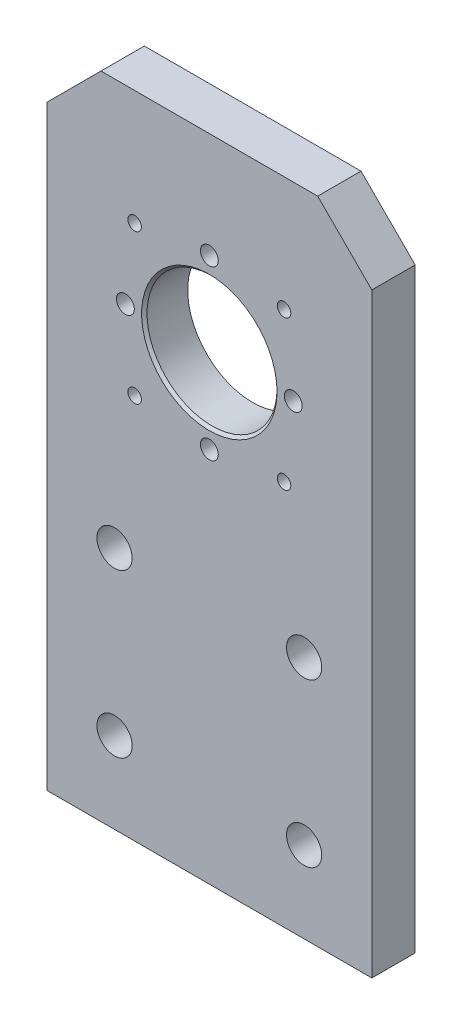
ISO-10303-21;
HEADER;
FILE_DESCRIPTION(('STEP AP214'),'2;1');
FILE_NAME('part.step','',(''),(''),'','','');
FILE_SCHEMA(('AUTOMOTIVE_DESIGN { 1 0 10303 214 1 1 1 1 }'));
ENDSEC;
DATA;
#1=APPLICATION_CONTEXT('core data for automotive mechanical design processes');
#2=APPLICATION_PROTOCOL_DEFINITION('international standard','automotive_design',2000,#1);
#3=PRODUCT_CONTEXT('',#1,'mechanical');
#4=PRODUCT('Part','Part','',(#3));
#5=PRODUCT_RELATED_PRODUCT_CATEGORY('part','',(#4));
#6=PRODUCT_DEFINITION_FORMATION('','',#4);
#7=PRODUCT_DEFINITION_CONTEXT('part definition',#1,'design');
#8=PRODUCT_DEFINITION('design','',#6,#7);
#9=PRODUCT_DEFINITION_SHAPE('','',#8);
#10=(LENGTH_UNIT() NAMED_UNIT(*) SI_UNIT(.MILLI.,.METRE.));
#11=(NAMED_UNIT(*) PLANE_ANGLE_UNIT() SI_UNIT($,.RADIAN.));
#12=(NAMED_UNIT(*) SI_UNIT($,.STERADIAN.) SOLID_ANGLE_UNIT());
#13=UNCERTAINTY_MEASURE_WITH_UNIT(LENGTH_MEASURE(1.E-05),#10,'distance_accuracy_value','');
#14=(GEOMETRIC_REPRESENTATION_CONTEXT(3) GLOBAL_UNCERTAINTY_ASSIGNED_CONTEXT((#13)) GLOBAL_UNIT_ASSIGNED_CONTEXT((#10,
#11,#12)) REPRESENTATION_CONTEXT('',''));
#15=CARTESIAN_POINT('',(0.,0.,0.));
#16=DIRECTION('',(0.,0.,1.));
#17=DIRECTION('',(1.,0.,0.));
#18=AXIS2_PLACEMENT_3D('',#15,#16,#17);
#19=CARTESIAN_POINT('',(0.,0.,8.));
#20=DIRECTION('',(0.,0.,1.));
#21=DIRECTION('',(1.,0.,0.));
#22=AXIS2_PLACEMENT_3D('',#19,#20,#21);
#23=PLANE('',#22);
#24=CARTESIAN_POINT('',(0.,25.,8.));
#25=DIRECTION('',(0.,0.,1.));
#26=DIRECTION('',(1.,0.,0.));
#27=AXIS2_PLACEMENT_3D('',#24,#25,#26);
#28=CIRCLE('',#27,12.5);
#29=CARTESIAN_POINT('',(12.5,25.,8.));
#30=VERTEX_POINT('',#29);
#31=EDGE_CURVE('E113',#30,#30,#28,.F.);
#32=ORIENTED_EDGE('',*,*,#31,.T.);
#33=EDGE_LOOP('',(#32));
#34=FACE_BOUND('',#33,.T.);
#35=CARTESIAN_POINT('',(-15.5,25.,8.));
#36=DIRECTION('',(0.,0.,1.));
#37=DIRECTION('',(1.,0.,0.));
#38=AXIS2_PLACEMENT_3D('',#35,#36,#37);
#39=CIRCLE('',#38,1.64999999999999);
#40=CARTESIAN_POINT('',(-13.85,25.,8.));
#41=VERTEX_POINT('',#40);
#42=EDGE_CURVE('E226',#41,#41,#39,.T.);
#43=ORIENTED_EDGE('',*,*,#42,.F.);
#44=EDGE_LOOP('',(#43));
#45=FACE_BOUND('',#44,.T.);
#46=CARTESIAN_POINT('',(0.,40.5,8.));
#47=DIRECTION('',(0.,0.,1.));
#48=DIRECTION('',(1.,0.,0.));
#49=AXIS2_PLACEMENT_3D('',#46,#47,#48);
#50=CIRCLE('',#49,1.64999999999999);
#51=CARTESIAN_POINT('',(1.64999999999999,40.5,8.));
#52=VERTEX_POINT('',#51);
#53=EDGE_CURVE('E220',#52,#52,#50,.T.);
#54=ORIENTED_EDGE('',*,*,#53,.F.);
#55=EDGE_LOOP('',(#54));
#56=FACE_BOUND('',#55,.T.);
#57=CARTESIAN_POINT('',(15.5,25.,8.));
#58=DIRECTION('',(0.,0.,1.));
#59=DIRECTION('',(1.,0.,0.));
#60=AXIS2_PLACEMENT_3D('',#57,#58,#59);
#61=CIRCLE('',#60,1.64999999999999);
#62=CARTESIAN_POINT('',(17.15,25.,8.));
#63=VERTEX_POINT('',#62);
#64=EDGE_CURVE('E214',#63,#63,#61,.T.);
#65=ORIENTED_EDGE('',*,*,#64,.F.);
#66=EDGE_LOOP('',(#65));
#67=FACE_BOUND('',#66,.T.);
#68=CARTESIAN_POINT('',(0.,9.5,8.));
#69=DIRECTION('',(0.,0.,1.));
#70=DIRECTION('',(1.,0.,0.));
#71=AXIS2_PLACEMENT_3D('',#68,#69,#70);
#72=CIRCLE('',#71,1.64999999999999);
#73=CARTESIAN_POINT('',(1.64999999999999,9.5,8.));
#74=VERTEX_POINT('',#73);
#75=EDGE_CURVE('E208',#74,#74,#72,.T.);
#76=ORIENTED_EDGE('',*,*,#75,.F.);
#77=EDGE_LOOP('',(#76));
#78=FACE_BOUND('',#77,.T.);
#79=CARTESIAN_POINT('',(-13.7885822331377,38.7885822331377,8.));
#80=DIRECTION('',(0.,0.,1.));
#81=DIRECTION('',(1.,0.,0.));
#82=AXIS2_PLACEMENT_3D('',#79,#80,#81);
#83=CIRCLE('',#82,1.24999999999999);
#84=CARTESIAN_POINT('',(-12.5385822331377,38.7885822331377,8.));
#85=VERTEX_POINT('',#84);
#86=EDGE_CURVE('E202',#85,#85,#83,.T.);
#87=ORIENTED_EDGE('',*,*,#86,.F.);
#88=EDGE_LOOP('',(#87));
#89=FACE_BOUND('',#88,.T.);
#90=CARTESIAN_POINT('',(-13.7885822331377,11.2114177668623,8.));
#91=DIRECTION('',(0.,0.,1.));
#92=DIRECTION('',(1.,0.,0.));
#93=AXIS2_PLACEMENT_3D('',#90,#91,#92);
#94=CIRCLE('',#93,1.24999999999999);
#95=CARTESIAN_POINT('',(-12.5385822331377,11.2114177668623,8.));
#96=VERTEX_POINT('',#95);
#97=EDGE_CURVE('E196',#96,#96,#94,.T.);
#98=ORIENTED_EDGE('',*,*,#97,.F.);
#99=EDGE_LOOP('',(#98));
#100=FACE_BOUND('',#99,.T.);
#101=CARTESIAN_POINT('',(13.7885822331377,11.2114177668623,8.));
#102=DIRECTION('',(0.,0.,1.));
#103=DIRECTION('',(1.,0.,0.));
#104=AXIS2_PLACEMENT_3D('',#101,#102,#103);
#105=CIRCLE('',#104,1.24999999999999);
#106=CARTESIAN_POINT('',(15.0385822331377,11.2114177668623,8.));
#107=VERTEX_POINT('',#106);
#108=EDGE_CURVE('E190',#107,#107,#105,.T.);
#109=ORIENTED_EDGE('',*,*,#108,.F.);
#110=EDGE_LOOP('',(#109));
#111=FACE_BOUND('',#110,.T.);
#112=CARTESIAN_POINT('',(13.7885822331377,38.7885822331376,8.));
#113=DIRECTION('',(0.,0.,1.));
#114=DIRECTION('',(1.,0.,0.));
#115=AXIS2_PLACEMENT_3D('',#112,#113,#114);
#116=CIRCLE('',#115,1.24999999999999);
#117=CARTESIAN_POINT('',(15.0385822331377,38.7885822331376,8.));
#118=VERTEX_POINT('',#117);
#119=EDGE_CURVE('E184',#118,#118,#116,.T.);
#120=ORIENTED_EDGE('',*,*,#119,.F.);
#121=EDGE_LOOP('',(#120));
#122=FACE_BOUND('',#121,.T.);
#123=CARTESIAN_POINT('',(17.5,-15.,8.));
#124=DIRECTION('',(0.,0.,1.));
#125=DIRECTION('',(-1.,0.,0.));
#126=AXIS2_PLACEMENT_3D('',#123,#124,#125);
#127=CIRCLE('',#126,3.25);
#128=CARTESIAN_POINT('',(14.25,-15.,8.));
#129=VERTEX_POINT('',#128);
#130=EDGE_CURVE('E170',#129,#129,#127,.T.);
#131=ORIENTED_EDGE('',*,*,#130,.F.);
#132=EDGE_LOOP('',(#131));
#133=FACE_BOUND('',#132,.T.);
#134=CARTESIAN_POINT('',(-17.5,-45.,8.));
#135=DIRECTION('',(0.,0.,1.));
#136=DIRECTION('',(1.,0.,0.));
#137=AXIS2_PLACEMENT_3D('',#134,#135,#136);
#138=CIRCLE('',#137,3.25);
#139=CARTESIAN_POINT('',(-14.25,-45.,8.));
#140=VERTEX_POINT('',#139);
#141=EDGE_CURVE('E158',#140,#140,#138,.T.);
#142=ORIENTED_EDGE('',*,*,#141,.F.);
#143=EDGE_LOOP('',(#142));
#144=FACE_BOUND('',#143,.T.);
#145=DIRECTION('',(0.,1.,0.));
#146=VECTOR('',#145,1.);
#147=CARTESIAN_POINT('',(30.,-60.,8.));
#148=LINE('',#147,#146);
#149=CARTESIAN_POINT('',(30.,-60.,8.));
#150=VERTEX_POINT('',#149);
#151=CARTESIAN_POINT('',(30.,50.,8.));
#152=VERTEX_POINT('',#151);
#153=EDGE_CURVE('E104',#150,#152,#148,.T.);
#154=ORIENTED_EDGE('',*,*,#153,.T.);
#155=DIRECTION('',(0.707106781186547,-0.707106781186548,0.));
#156=VECTOR('',#155,1.);
#157=CARTESIAN_POINT('',(40.,39.9999999999999,8.));
#158=LINE('',#157,#156);
#159=CARTESIAN_POINT('',(20.,60.,8.));
#160=VERTEX_POINT('',#159);
#161=EDGE_CURVE('E43',#152,#160,#158,.F.);
#162=ORIENTED_EDGE('',*,*,#161,.T.);
#163=DIRECTION('',(-1.,0.,0.));
#164=VECTOR('',#163,1.);
#165=CARTESIAN_POINT('',(30.,60.,8.));
#166=LINE('',#165,#164);
#167=CARTESIAN_POINT('',(-20.,60.,8.));
#168=VERTEX_POINT('',#167);
#169=EDGE_CURVE('E115',#160,#168,#166,.T.);
#170=ORIENTED_EDGE('',*,*,#169,.T.);
#171=DIRECTION('',(0.707106781186549,0.707106781186546,0.));
#172=VECTOR('',#171,1.);
#173=CARTESIAN_POINT('',(-39.9999999999999,40.0000000000001,8.));
#174=LINE('',#173,#172);
#175=CARTESIAN_POINT('',(-30.,50.,8.));
#176=VERTEX_POINT('',#175);
#177=EDGE_CURVE('E50',#168,#176,#174,.F.);
#178=ORIENTED_EDGE('',*,*,#177,.T.);
#179=DIRECTION('',(0.,-1.,0.));
#180=VECTOR('',#179,1.);
#181=CARTESIAN_POINT('',(-30.,-60.,8.));
#182=LINE('',#181,#180);
#183=CARTESIAN_POINT('',(-30.,-60.,8.));
#184=VERTEX_POINT('',#183);
#185=EDGE_CURVE('E88',#176,#184,#182,.T.);
#186=ORIENTED_EDGE('',*,*,#185,.T.);
#187=DIRECTION('',(1.,0.,0.));
#188=VECTOR('',#187,1.);
#189=CARTESIAN_POINT('',(30.,-60.,8.));
#190=LINE('',#189,#188);
#191=EDGE_CURVE('E91',#184,#150,#190,.T.);
#192=ORIENTED_EDGE('',*,*,#191,.T.);
#193=EDGE_LOOP('',(#154,#162,#170,#178,#186,#192));
#194=FACE_BOUND('',#193,.T.);
#195=CARTESIAN_POINT('',(-17.5,-15.,8.));
#196=DIRECTION('',(0.,0.,1.));
#197=DIRECTION('',(1.,0.,0.));
#198=AXIS2_PLACEMENT_3D('',#195,#196,#197);
#199=CIRCLE('',#198,3.25);
#200=CARTESIAN_POINT('',(-14.25,-15.,8.));
#201=VERTEX_POINT('',#200);
#202=EDGE_CURVE('E152',#201,#201,#199,.T.);
#203=ORIENTED_EDGE('',*,*,#202,.F.);
#204=EDGE_LOOP('',(#203));
#205=FACE_BOUND('',#204,.T.);
#206=CARTESIAN_POINT('',(17.5,-45.,8.));
#207=DIRECTION('',(0.,0.,1.));
#208=DIRECTION('',(-1.,0.,0.));
#209=AXIS2_PLACEMENT_3D('',#206,#207,#208);
#210=CIRCLE('',#209,3.25);
#211=CARTESIAN_POINT('',(14.25,-45.,8.));
#212=VERTEX_POINT('',#211);
#213=EDGE_CURVE('E164',#212,#212,#210,.T.);
#214=ORIENTED_EDGE('',*,*,#213,.F.);
#215=EDGE_LOOP('',(#214));
#216=FACE_BOUND('',#215,.T.);
#217=ADVANCED_FACE('F35',(#34,#45,#56,#67,#78,#89,#100,#111,#122,#133,#144,#194,#205,#216),#23,.T.);
#218=CARTESIAN_POINT('',(0.,0.,0.));
#219=DIRECTION('',(0.,0.,1.));
#220=DIRECTION('',(1.,0.,0.));
#221=AXIS2_PLACEMENT_3D('',#218,#219,#220);
#222=PLANE('',#221);
#223=CARTESIAN_POINT('',(-15.5,25.,0.));
#224=DIRECTION('',(0.,0.,1.));
#225=DIRECTION('',(1.,0.,0.));
#226=AXIS2_PLACEMENT_3D('',#223,#224,#225);
#227=CIRCLE('',#226,1.65);
#228=CARTESIAN_POINT('',(-13.85,25.,0.));
#229=VERTEX_POINT('',#228);
#230=EDGE_CURVE('E223',#229,#229,#227,.T.);
#231=ORIENTED_EDGE('',*,*,#230,.T.);
#232=EDGE_LOOP('',(#231));
#233=FACE_BOUND('',#232,.T.);
#234=CARTESIAN_POINT('',(0.,40.5,0.));
#235=DIRECTION('',(0.,0.,1.));
#236=DIRECTION('',(1.,0.,0.));
#237=AXIS2_PLACEMENT_3D('',#234,#235,#236);
#238=CIRCLE('',#237,1.65);
#239=CARTESIAN_POINT('',(1.65,40.5,0.));
#240=VERTEX_POINT('',#239);
#241=EDGE_CURVE('E217',#240,#240,#238,.T.);
#242=ORIENTED_EDGE('',*,*,#241,.T.);
#243=EDGE_LOOP('',(#242));
#244=FACE_BOUND('',#243,.T.);
#245=CARTESIAN_POINT('',(15.5,25.,0.));
#246=DIRECTION('',(0.,0.,1.));
#247=DIRECTION('',(1.,0.,0.));
#248=AXIS2_PLACEMENT_3D('',#245,#246,#247);
#249=CIRCLE('',#248,1.65);
#250=CARTESIAN_POINT('',(17.15,25.,0.));
#251=VERTEX_POINT('',#250);
#252=EDGE_CURVE('E211',#251,#251,#249,.T.);
#253=ORIENTED_EDGE('',*,*,#252,.T.);
#254=EDGE_LOOP('',(#253));
#255=FACE_BOUND('',#254,.T.);
#256=CARTESIAN_POINT('',(0.,9.5,0.));
#257=DIRECTION('',(0.,0.,1.));
#258=DIRECTION('',(1.,0.,0.));
#259=AXIS2_PLACEMENT_3D('',#256,#257,#258);
#260=CIRCLE('',#259,1.65);
#261=CARTESIAN_POINT('',(1.65,9.5,0.));
#262=VERTEX_POINT('',#261);
#263=EDGE_CURVE('E205',#262,#262,#260,.T.);
#264=ORIENTED_EDGE('',*,*,#263,.T.);
#265=EDGE_LOOP('',(#264));
#266=FACE_BOUND('',#265,.T.);
#267=CARTESIAN_POINT('',(-13.7885822331377,38.7885822331377,0.));
#268=DIRECTION('',(0.,0.,1.));
#269=DIRECTION('',(1.,0.,0.));
#270=AXIS2_PLACEMENT_3D('',#267,#268,#269);
#271=CIRCLE('',#270,1.25);
#272=CARTESIAN_POINT('',(-12.5385822331377,38.7885822331377,0.));
#273=VERTEX_POINT('',#272);
#274=EDGE_CURVE('E199',#273,#273,#271,.T.);
#275=ORIENTED_EDGE('',*,*,#274,.T.);
#276=EDGE_LOOP('',(#275));
#277=FACE_BOUND('',#276,.T.);
#278=CARTESIAN_POINT('',(-13.7885822331377,11.2114177668623,0.));
#279=DIRECTION('',(0.,0.,1.));
#280=DIRECTION('',(1.,0.,0.));
#281=AXIS2_PLACEMENT_3D('',#278,#279,#280);
#282=CIRCLE('',#281,1.25);
#283=CARTESIAN_POINT('',(-12.5385822331377,11.2114177668623,0.));
#284=VERTEX_POINT('',#283);
#285=EDGE_CURVE('E193',#284,#284,#282,.T.);
#286=ORIENTED_EDGE('',*,*,#285,.T.);
#287=EDGE_LOOP('',(#286));
#288=FACE_BOUND('',#287,.T.);
#289=CARTESIAN_POINT('',(13.7885822331377,11.2114177668623,0.));
#290=DIRECTION('',(0.,0.,1.));
#291=DIRECTION('',(1.,0.,0.));
#292=AXIS2_PLACEMENT_3D('',#289,#290,#291);
#293=CIRCLE('',#292,1.25);
#294=CARTESIAN_POINT('',(15.0385822331377,11.2114177668623,0.));
#295=VERTEX_POINT('',#294);
#296=EDGE_CURVE('E187',#295,#295,#293,.T.);
#297=ORIENTED_EDGE('',*,*,#296,.T.);
#298=EDGE_LOOP('',(#297));
#299=FACE_BOUND('',#298,.T.);
#300=CARTESIAN_POINT('',(13.7885822331377,38.7885822331376,0.));
#301=DIRECTION('',(0.,0.,1.));
#302=DIRECTION('',(1.,0.,0.));
#303=AXIS2_PLACEMENT_3D('',#300,#301,#302);
#304=CIRCLE('',#303,1.25);
#305=CARTESIAN_POINT('',(15.0385822331377,38.7885822331376,0.));
#306=VERTEX_POINT('',#305);
#307=EDGE_CURVE('E181',#306,#306,#304,.T.);
#308=ORIENTED_EDGE('',*,*,#307,.T.);
#309=EDGE_LOOP('',(#308));
#310=FACE_BOUND('',#309,.T.);
#311=DIRECTION('',(-1.,0.,0.));
#312=VECTOR('',#311,1.);
#313=CARTESIAN_POINT('',(30.,60.,0.));
#314=LINE('',#313,#312);
#315=CARTESIAN_POINT('',(20.,60.,0.));
#316=VERTEX_POINT('',#315);
#317=CARTESIAN_POINT('',(-20.,60.,0.));
#318=VERTEX_POINT('',#317);
#319=EDGE_CURVE('E96',#316,#318,#314,.T.);
#320=ORIENTED_EDGE('',*,*,#319,.F.);
#321=DIRECTION('',(-0.707106781186547,0.707106781186548,0.));
#322=VECTOR('',#321,1.);
#323=CARTESIAN_POINT('',(20.,60.,0.));
#324=LINE('',#323,#322);
#325=CARTESIAN_POINT('',(30.,50.,0.));
#326=VERTEX_POINT('',#325);
#327=EDGE_CURVE('E128',#316,#326,#324,.F.);
#328=ORIENTED_EDGE('',*,*,#327,.T.);
#329=DIRECTION('',(0.,1.,0.));
#330=VECTOR('',#329,1.);
#331=CARTESIAN_POINT('',(30.,-60.,0.));
#332=LINE('',#331,#330);
#333=CARTESIAN_POINT('',(30.,-60.,0.));
#334=VERTEX_POINT('',#333);
#335=EDGE_CURVE('E146',#334,#326,#332,.T.);
#336=ORIENTED_EDGE('',*,*,#335,.F.);
#337=DIRECTION('',(1.,0.,0.));
#338=VECTOR('',#337,1.);
#339=CARTESIAN_POINT('',(30.,-60.,0.));
#340=LINE('',#339,#338);
#341=CARTESIAN_POINT('',(-30.,-60.,0.));
#342=VERTEX_POINT('',#341);
#343=EDGE_CURVE('E148',#342,#334,#340,.T.);
#344=ORIENTED_EDGE('',*,*,#343,.F.);
#345=DIRECTION('',(0.,-1.,0.));
#346=VECTOR('',#345,1.);
#347=CARTESIAN_POINT('',(-30.,-60.,0.));
#348=LINE('',#347,#346);
#349=CARTESIAN_POINT('',(-30.,50.,0.));
#350=VERTEX_POINT('',#349);
#351=EDGE_CURVE('E108',#350,#342,#348,.T.);
#352=ORIENTED_EDGE('',*,*,#351,.F.);
#353=DIRECTION('',(-0.707106781186549,-0.707106781186546,0.));
#354=VECTOR('',#353,1.);
#355=CARTESIAN_POINT('',(-30.,50.,0.));
#356=LINE('',#355,#354);
#357=EDGE_CURVE('E126',#350,#318,#356,.F.);
#358=ORIENTED_EDGE('',*,*,#357,.T.);
#359=EDGE_LOOP('',(#320,#328,#336,#344,#352,#358));
#360=FACE_BOUND('',#359,.T.);
#361=CARTESIAN_POINT('',(-17.5,-15.,0.));
#362=DIRECTION('',(0.,0.,1.));
#363=DIRECTION('',(1.,0.,0.));
#364=AXIS2_PLACEMENT_3D('',#361,#362,#363);
#365=CIRCLE('',#364,3.25);
#366=CARTESIAN_POINT('',(-14.25,-15.,0.));
#367=VERTEX_POINT('',#366);
#368=EDGE_CURVE('E155',#367,#367,#365,.T.);
#369=ORIENTED_EDGE('',*,*,#368,.T.);
#370=EDGE_LOOP('',(#369));
#371=FACE_BOUND('',#370,.T.);
#372=CARTESIAN_POINT('',(-17.5,-45.,0.));
#373=DIRECTION('',(0.,0.,1.));
#374=DIRECTION('',(1.,0.,0.));
#375=AXIS2_PLACEMENT_3D('',#372,#373,#374);
#376=CIRCLE('',#375,3.25);
#377=CARTESIAN_POINT('',(-14.25,-45.,0.));
#378=VERTEX_POINT('',#377);
#379=EDGE_CURVE('E161',#378,#378,#376,.T.);
#380=ORIENTED_EDGE('',*,*,#379,.T.);
#381=EDGE_LOOP('',(#380));
#382=FACE_BOUND('',#381,.T.);
#383=CARTESIAN_POINT('',(17.5,-45.,0.));
#384=DIRECTION('',(0.,0.,1.));
#385=DIRECTION('',(-1.,0.,0.));
#386=AXIS2_PLACEMENT_3D('',#383,#384,#385);
#387=CIRCLE('',#386,3.25);
#388=CARTESIAN_POINT('',(14.25,-45.,0.));
#389=VERTEX_POINT('',#388);
#390=EDGE_CURVE('E167',#389,#389,#387,.T.);
#391=ORIENTED_EDGE('',*,*,#390,.T.);
#392=EDGE_LOOP('',(#391));
#393=FACE_BOUND('',#392,.T.);
#394=CARTESIAN_POINT('',(17.5,-15.,0.));
#395=DIRECTION('',(0.,0.,1.));
#396=DIRECTION('',(-1.,0.,0.));
#397=AXIS2_PLACEMENT_3D('',#394,#395,#396);
#398=CIRCLE('',#397,3.25);
#399=CARTESIAN_POINT('',(14.25,-15.,0.));
#400=VERTEX_POINT('',#399);
#401=EDGE_CURVE('E173',#400,#400,#398,.T.);
#402=ORIENTED_EDGE('',*,*,#401,.T.);
#403=EDGE_LOOP('',(#402));
#404=FACE_BOUND('',#403,.T.);
#405=CARTESIAN_POINT('',(0.,25.,0.));
#406=DIRECTION('',(0.,0.,1.));
#407=DIRECTION('',(1.,0.,0.));
#408=AXIS2_PLACEMENT_3D('',#405,#406,#407);
#409=CIRCLE('',#408,12.);
#410=CARTESIAN_POINT('',(12.,25.,0.));
#411=VERTEX_POINT('',#410);
#412=EDGE_CURVE('E176',#411,#411,#409,.T.);
#413=ORIENTED_EDGE('',*,*,#412,.T.);
#414=EDGE_LOOP('',(#413));
#415=FACE_BOUND('',#414,.T.);
#416=ADVANCED_FACE('F144',(#233,#244,#255,#266,#277,#288,#299,#310,#360,#371,#382,#393,#404,
#415),#222,.F.);
#417=CARTESIAN_POINT('',(-30.,-60.,8.));
#418=DIRECTION('',(1.,0.,0.));
#419=DIRECTION('',(0.,0.,-1.));
#420=AXIS2_PLACEMENT_3D('',#417,#418,#419);
#421=PLANE('',#420);
#422=ORIENTED_EDGE('',*,*,#185,.F.);
#423=DIRECTION('',(0.,0.,-1.));
#424=VECTOR('',#423,1.);
#425=CARTESIAN_POINT('',(-30.,50.,8.));
#426=LINE('',#425,#424);
#427=EDGE_CURVE('E11',#176,#350,#426,.T.);
#428=ORIENTED_EDGE('',*,*,#427,.T.);
#429=ORIENTED_EDGE('',*,*,#351,.T.);
#430=DIRECTION('',(0.,0.,-1.));
#431=VECTOR('',#430,1.);
#432=CARTESIAN_POINT('',(-30.,-60.,8.));
#433=LINE('',#432,#431);
#434=EDGE_CURVE('E101',#184,#342,#433,.T.);
#435=ORIENTED_EDGE('',*,*,#434,.F.);
#436=EDGE_LOOP('',(#422,#428,#429,#435));
#437=FACE_BOUND('',#436,.T.);
#438=ADVANCED_FACE('F106',(#437),#421,.F.);
#439=CARTESIAN_POINT('',(30.,-60.,8.));
#440=DIRECTION('',(0.,1.,0.));
#441=DIRECTION('',(-1.,0.,0.));
#442=AXIS2_PLACEMENT_3D('',#439,#440,#441);
#443=PLANE('',#442);
#444=ORIENTED_EDGE('',*,*,#343,.T.);
#445=DIRECTION('',(0.,0.,-1.));
#446=VECTOR('',#445,1.);
#447=CARTESIAN_POINT('',(30.,-60.,8.));
#448=LINE('',#447,#446);
#449=EDGE_CURVE('E103',#150,#334,#448,.T.);
#450=ORIENTED_EDGE('',*,*,#449,.F.);
#451=ORIENTED_EDGE('',*,*,#191,.F.);
#452=ORIENTED_EDGE('',*,*,#434,.T.);
#453=EDGE_LOOP('',(#444,#450,#451,#452));
#454=FACE_BOUND('',#453,.T.);
#455=ADVANCED_FACE('F100',(#454),#443,.F.);
#456=CARTESIAN_POINT('',(30.,-60.,8.));
#457=DIRECTION('',(-1.,0.,0.));
#458=DIRECTION('',(0.,0.,1.));
#459=AXIS2_PLACEMENT_3D('',#456,#457,#458);
#460=PLANE('',#459);
#461=ORIENTED_EDGE('',*,*,#335,.T.);
#462=DIRECTION('',(0.,0.,1.));
#463=VECTOR('',#462,1.);
#464=CARTESIAN_POINT('',(30.,50.,8.));
#465=LINE('',#464,#463);
#466=EDGE_CURVE('E58',#326,#152,#465,.T.);
#467=ORIENTED_EDGE('',*,*,#466,.T.);
#468=ORIENTED_EDGE('',*,*,#153,.F.);
#469=ORIENTED_EDGE('',*,*,#449,.T.);
#470=EDGE_LOOP('',(#461,#467,#468,#469));
#471=FACE_BOUND('',#470,.T.);
#472=ADVANCED_FACE('F147',(#471),#460,.F.);
#473=CARTESIAN_POINT('',(30.,60.,8.));
#474=DIRECTION('',(0.,-1.,0.));
#475=DIRECTION('',(1.,0.,0.));
#476=AXIS2_PLACEMENT_3D('',#473,#474,#475);
#477=PLANE('',#476);
#478=ORIENTED_EDGE('',*,*,#169,.F.);
#479=DIRECTION('',(0.,0.,-1.));
#480=VECTOR('',#479,1.);
#481=CARTESIAN_POINT('',(20.,60.,8.));
#482=LINE('',#481,#480);
#483=EDGE_CURVE('E123',#160,#316,#482,.T.);
#484=ORIENTED_EDGE('',*,*,#483,.T.);
#485=ORIENTED_EDGE('',*,*,#319,.T.);
#486=DIRECTION('',(0.,0.,1.));
#487=VECTOR('',#486,1.);
#488=CARTESIAN_POINT('',(-20.,60.,8.));
#489=LINE('',#488,#487);
#490=EDGE_CURVE('E121',#318,#168,#489,.T.);
#491=ORIENTED_EDGE('',*,*,#490,.T.);
#492=EDGE_LOOP('',(#478,#484,#485,#491));
#493=FACE_BOUND('',#492,.T.);
#494=ADVANCED_FACE('F136',(#493),#477,.F.);
#495=CARTESIAN_POINT('',(-17.5,-15.,8.));
#496=DIRECTION('',(0.,0.,-1.));
#497=DIRECTION('',(-1.,0.,0.));
#498=AXIS2_PLACEMENT_3D('',#495,#496,#497);
#499=CYLINDRICAL_SURFACE('',#498,3.25);
#500=ORIENTED_EDGE('',*,*,#202,.T.);
#501=EDGE_LOOP('',(#500));
#502=FACE_BOUND('',#501,.T.);
#503=ORIENTED_EDGE('',*,*,#368,.F.);
#504=EDGE_LOOP('',(#503));
#505=FACE_BOUND('',#504,.T.);
#506=ADVANCED_FACE('F258',(#502,#505),#499,.F.);
#507=CARTESIAN_POINT('',(-17.5,-45.,8.));
#508=DIRECTION('',(0.,0.,-1.));
#509=DIRECTION('',(-1.,0.,0.));
#510=AXIS2_PLACEMENT_3D('',#507,#508,#509);
#511=CYLINDRICAL_SURFACE('',#510,3.25);
#512=ORIENTED_EDGE('',*,*,#141,.T.);
#513=EDGE_LOOP('',(#512));
#514=FACE_BOUND('',#513,.T.);
#515=ORIENTED_EDGE('',*,*,#379,.F.);
#516=EDGE_LOOP('',(#515));
#517=FACE_BOUND('',#516,.T.);
#518=ADVANCED_FACE('F254',(#514,#517),#511,.F.);
#519=CARTESIAN_POINT('',(17.5,-45.,8.));
#520=DIRECTION('',(0.,0.,-1.));
#521=DIRECTION('',(-1.,0.,0.));
#522=AXIS2_PLACEMENT_3D('',#519,#520,#521);
#523=CYLINDRICAL_SURFACE('',#522,3.25);
#524=ORIENTED_EDGE('',*,*,#213,.T.);
#525=EDGE_LOOP('',(#524));
#526=FACE_BOUND('',#525,.T.);
#527=ORIENTED_EDGE('',*,*,#390,.F.);
#528=EDGE_LOOP('',(#527));
#529=FACE_BOUND('',#528,.T.);
#530=ADVANCED_FACE('F257',(#526,#529),#523,.F.);
#531=CARTESIAN_POINT('',(17.5,-15.,8.));
#532=DIRECTION('',(0.,0.,-1.));
#533=DIRECTION('',(-1.,0.,0.));
#534=AXIS2_PLACEMENT_3D('',#531,#532,#533);
#535=CYLINDRICAL_SURFACE('',#534,3.25);
#536=ORIENTED_EDGE('',*,*,#130,.T.);
#537=EDGE_LOOP('',(#536));
#538=FACE_BOUND('',#537,.T.);
#539=ORIENTED_EDGE('',*,*,#401,.F.);
#540=EDGE_LOOP('',(#539));
#541=FACE_BOUND('',#540,.T.);
#542=ADVANCED_FACE('F275',(#538,#541),#535,.F.);
#543=CARTESIAN_POINT('',(0.,25.,8.));
#544=DIRECTION('',(0.,0.,-1.));
#545=DIRECTION('',(-1.,0.,0.));
#546=AXIS2_PLACEMENT_3D('',#543,#544,#545);
#547=CYLINDRICAL_SURFACE('',#546,12.);
#548=CARTESIAN_POINT('',(0.,25.,7.50000000000002));
#549=DIRECTION('',(0.,0.,1.));
#550=DIRECTION('',(1.,0.,0.));
#551=AXIS2_PLACEMENT_3D('',#548,#549,#550);
#552=CIRCLE('',#551,12.);
#553=CARTESIAN_POINT('',(12.,25.,7.50000000000002));
#554=VERTEX_POINT('',#553);
#555=EDGE_CURVE('E110',#554,#554,#552,.T.);
#556=ORIENTED_EDGE('',*,*,#555,.T.);
#557=EDGE_LOOP('',(#556));
#558=FACE_BOUND('',#557,.T.);
#559=ORIENTED_EDGE('',*,*,#412,.F.);
#560=EDGE_LOOP('',(#559));
#561=FACE_BOUND('',#560,.T.);
#562=ADVANCED_FACE('F272',(#558,#561),#547,.F.);
#563=CARTESIAN_POINT('',(13.7885822331377,38.7885822331376,8.));
#564=DIRECTION('',(0.,0.,1.));
#565=DIRECTION('',(1.,0.,0.));
#566=AXIS2_PLACEMENT_3D('',#563,#564,#565);
#567=CYLINDRICAL_SURFACE('',#566,1.24999999999999);
#568=ORIENTED_EDGE('',*,*,#307,.F.);
#569=EDGE_LOOP('',(#568));
#570=FACE_BOUND('',#569,.T.);
#571=ORIENTED_EDGE('',*,*,#119,.T.);
#572=EDGE_LOOP('',(#571));
#573=FACE_BOUND('',#572,.T.);
#574=ADVANCED_FACE('F274',(#570,#573),#567,.F.);
#575=CARTESIAN_POINT('',(13.7885822331377,11.2114177668623,8.));
#576=DIRECTION('',(0.,0.,1.));
#577=DIRECTION('',(1.,0.,0.));
#578=AXIS2_PLACEMENT_3D('',#575,#576,#577);
#579=CYLINDRICAL_SURFACE('',#578,1.24999999999999);
#580=ORIENTED_EDGE('',*,*,#296,.F.);
#581=EDGE_LOOP('',(#580));
#582=FACE_BOUND('',#581,.T.);
#583=ORIENTED_EDGE('',*,*,#108,.T.);
#584=EDGE_LOOP('',(#583));
#585=FACE_BOUND('',#584,.T.);
#586=ADVANCED_FACE('F282',(#582,#585),#579,.F.);
#587=CARTESIAN_POINT('',(-13.7885822331377,11.2114177668623,8.));
#588=DIRECTION('',(0.,0.,1.));
#589=DIRECTION('',(1.,0.,0.));
#590=AXIS2_PLACEMENT_3D('',#587,#588,#589);
#591=CYLINDRICAL_SURFACE('',#590,1.24999999999999);
#592=ORIENTED_EDGE('',*,*,#285,.F.);
#593=EDGE_LOOP('',(#592));
#594=FACE_BOUND('',#593,.T.);
#595=ORIENTED_EDGE('',*,*,#97,.T.);
#596=EDGE_LOOP('',(#595));
#597=FACE_BOUND('',#596,.T.);
#598=ADVANCED_FACE('F417',(#594,#597),#591,.F.);
#599=CARTESIAN_POINT('',(-13.7885822331377,38.7885822331377,8.));
#600=DIRECTION('',(0.,0.,1.));
#601=DIRECTION('',(1.,0.,0.));
#602=AXIS2_PLACEMENT_3D('',#599,#600,#601);
#603=CYLINDRICAL_SURFACE('',#602,1.24999999999999);
#604=ORIENTED_EDGE('',*,*,#274,.F.);
#605=EDGE_LOOP('',(#604));
#606=FACE_BOUND('',#605,.T.);
#607=ORIENTED_EDGE('',*,*,#86,.T.);
#608=EDGE_LOOP('',(#607));
#609=FACE_BOUND('',#608,.T.);
#610=ADVANCED_FACE('F406',(#606,#609),#603,.F.);
#611=CARTESIAN_POINT('',(0.,9.5,8.));
#612=DIRECTION('',(0.,0.,1.));
#613=DIRECTION('',(1.,0.,0.));
#614=AXIS2_PLACEMENT_3D('',#611,#612,#613);
#615=CYLINDRICAL_SURFACE('',#614,1.64999999999999);
#616=ORIENTED_EDGE('',*,*,#263,.F.);
#617=EDGE_LOOP('',(#616));
#618=FACE_BOUND('',#617,.T.);
#619=ORIENTED_EDGE('',*,*,#75,.T.);
#620=EDGE_LOOP('',(#619));
#621=FACE_BOUND('',#620,.T.);
#622=ADVANCED_FACE('F396',(#618,#621),#615,.F.);
#623=CARTESIAN_POINT('',(15.5,25.,8.));
#624=DIRECTION('',(0.,0.,1.));
#625=DIRECTION('',(1.,0.,0.));
#626=AXIS2_PLACEMENT_3D('',#623,#624,#625);
#627=CYLINDRICAL_SURFACE('',#626,1.64999999999999);
#628=ORIENTED_EDGE('',*,*,#252,.F.);
#629=EDGE_LOOP('',(#628));
#630=FACE_BOUND('',#629,.T.);
#631=ORIENTED_EDGE('',*,*,#64,.T.);
#632=EDGE_LOOP('',(#631));
#633=FACE_BOUND('',#632,.T.);
#634=ADVANCED_FACE('F385',(#630,#633),#627,.F.);
#635=CARTESIAN_POINT('',(0.,40.5,8.));
#636=DIRECTION('',(0.,0.,1.));
#637=DIRECTION('',(1.,0.,0.));
#638=AXIS2_PLACEMENT_3D('',#635,#636,#637);
#639=CYLINDRICAL_SURFACE('',#638,1.64999999999999);
#640=ORIENTED_EDGE('',*,*,#241,.F.);
#641=EDGE_LOOP('',(#640));
#642=FACE_BOUND('',#641,.T.);
#643=ORIENTED_EDGE('',*,*,#53,.T.);
#644=EDGE_LOOP('',(#643));
#645=FACE_BOUND('',#644,.T.);
#646=ADVANCED_FACE('F373',(#642,#645),#639,.F.);
#647=CARTESIAN_POINT('',(-15.5,25.,8.));
#648=DIRECTION('',(0.,0.,1.));
#649=DIRECTION('',(1.,0.,0.));
#650=AXIS2_PLACEMENT_3D('',#647,#648,#649);
#651=CYLINDRICAL_SURFACE('',#650,1.64999999999999);
#652=ORIENTED_EDGE('',*,*,#230,.F.);
#653=EDGE_LOOP('',(#652));
#654=FACE_BOUND('',#653,.T.);
#655=ORIENTED_EDGE('',*,*,#42,.T.);
#656=EDGE_LOOP('',(#655));
#657=FACE_BOUND('',#656,.T.);
#658=ADVANCED_FACE('F230',(#654,#657),#651,.F.);
#659=CARTESIAN_POINT('',(0.,25.,7.50000000000002));
#660=DIRECTION('',(0.,0.,1.));
#661=DIRECTION('',(1.,0.,0.));
#662=AXIS2_PLACEMENT_3D('',#659,#660,#661);
#663=CONICAL_SURFACE('',#662,12.,0.785398163397462);
#664=ORIENTED_EDGE('',*,*,#31,.F.);
#665=EDGE_LOOP('',(#664));
#666=FACE_BOUND('',#665,.T.);
#667=ORIENTED_EDGE('',*,*,#555,.F.);
#668=EDGE_LOOP('',(#667));
#669=FACE_BOUND('',#668,.T.);
#670=ADVANCED_FACE('F303',(#666,#669),#663,.F.);
#671=CARTESIAN_POINT('',(20.,60.,8.));
#672=DIRECTION('',(-0.707106781186548,-0.707106781186547,0.));
#673=DIRECTION('',(0.,0.,-1.));
#674=AXIS2_PLACEMENT_3D('',#671,#672,#673);
#675=PLANE('',#674);
#676=ORIENTED_EDGE('',*,*,#161,.F.);
#677=ORIENTED_EDGE('',*,*,#466,.F.);
#678=ORIENTED_EDGE('',*,*,#327,.F.);
#679=ORIENTED_EDGE('',*,*,#483,.F.);
#680=EDGE_LOOP('',(#676,#677,#678,#679));
#681=FACE_BOUND('',#680,.T.);
#682=ADVANCED_FACE('F141',(#681),#675,.F.);
#683=CARTESIAN_POINT('',(-30.,50.,8.));
#684=DIRECTION('',(0.707106781186546,-0.707106781186549,0.));
#685=DIRECTION('',(0.,0.,-1.));
#686=AXIS2_PLACEMENT_3D('',#683,#684,#685);
#687=PLANE('',#686);
#688=ORIENTED_EDGE('',*,*,#177,.F.);
#689=ORIENTED_EDGE('',*,*,#490,.F.);
#690=ORIENTED_EDGE('',*,*,#357,.F.);
#691=ORIENTED_EDGE('',*,*,#427,.F.);
#692=EDGE_LOOP('',(#688,#689,#690,#691));
#693=FACE_BOUND('',#692,.T.);
#694=ADVANCED_FACE('F37',(#693),#687,.F.);
#695=CLOSED_SHELL('',(#217,#416,#438,#455,#472,#494,#506,#518,#530,#542,#562,#574,#586,#598,
#610,#622,#634,#646,#658,#670,#682,#694));
#696=MANIFOLD_SOLID_BREP('B2',#695);
#697=ADVANCED_BREP_SHAPE_REPRESENTATION('',(#18,#696),#14);
#698=SHAPE_DEFINITION_REPRESENTATION(#9,#697);
ENDSEC;
END-ISO-10303-21;
